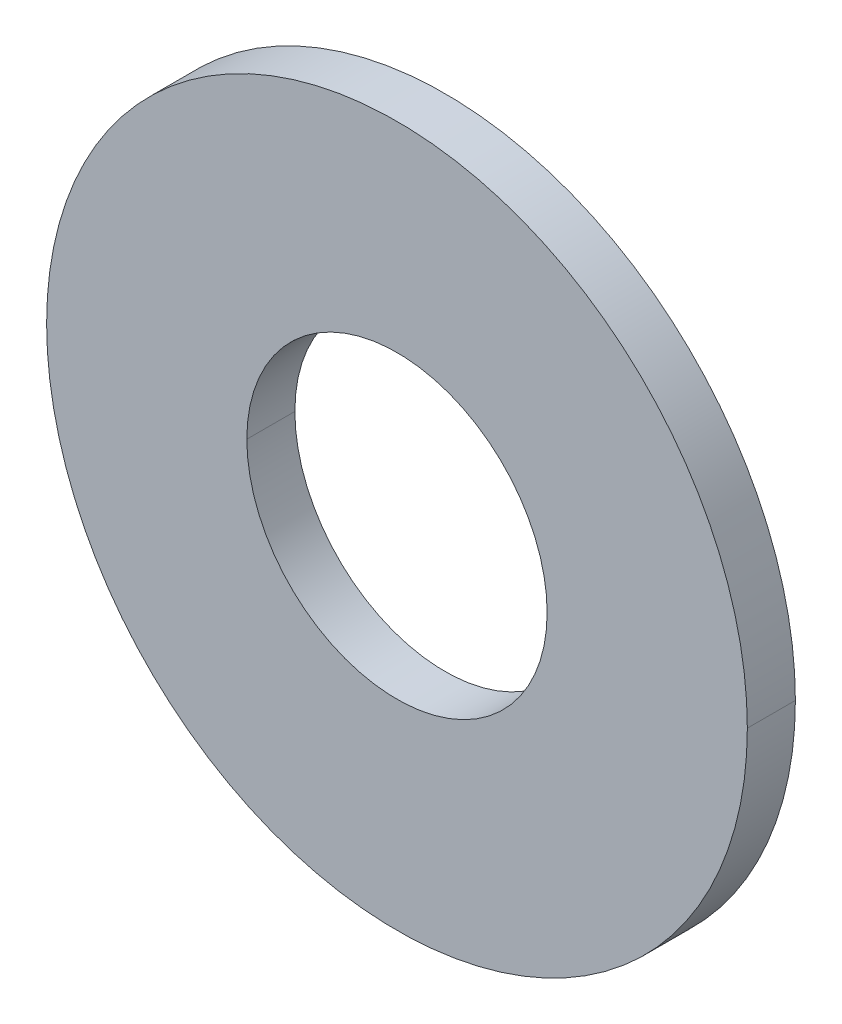
ISO-10303-21;
HEADER;
FILE_DESCRIPTION(('STEP AP214'),'2;1');
FILE_NAME('part.step','',(''),(''),'','','');
FILE_SCHEMA(('AUTOMOTIVE_DESIGN { 1 0 10303 214 1 1 1 1 }'));
ENDSEC;
DATA;
#1=APPLICATION_CONTEXT('core data for automotive mechanical design processes');
#2=APPLICATION_PROTOCOL_DEFINITION('international standard','automotive_design',2000,#1);
#3=PRODUCT_CONTEXT('',#1,'mechanical');
#4=PRODUCT('Part','Part','',(#3));
#5=PRODUCT_RELATED_PRODUCT_CATEGORY('part','',(#4));
#6=PRODUCT_DEFINITION_FORMATION('','',#4);
#7=PRODUCT_DEFINITION_CONTEXT('part definition',#1,'design');
#8=PRODUCT_DEFINITION('design','',#6,#7);
#9=PRODUCT_DEFINITION_SHAPE('','',#8);
#10=(LENGTH_UNIT() NAMED_UNIT(*) SI_UNIT(.MILLI.,.METRE.));
#11=(NAMED_UNIT(*) PLANE_ANGLE_UNIT() SI_UNIT($,.RADIAN.));
#12=(NAMED_UNIT(*) SI_UNIT($,.STERADIAN.) SOLID_ANGLE_UNIT());
#13=UNCERTAINTY_MEASURE_WITH_UNIT(LENGTH_MEASURE(1.E-05),#10,'distance_accuracy_value','');
#14=(GEOMETRIC_REPRESENTATION_CONTEXT(3) GLOBAL_UNCERTAINTY_ASSIGNED_CONTEXT((#13)) GLOBAL_UNIT_ASSIGNED_CONTEXT((#10,
#11,#12)) REPRESENTATION_CONTEXT('',''));
#15=CARTESIAN_POINT('',(0.,0.,0.));
#16=DIRECTION('',(0.,0.,1.));
#17=DIRECTION('',(1.,0.,0.));
#18=AXIS2_PLACEMENT_3D('',#15,#16,#17);
#19=CARTESIAN_POINT('',(0.,0.,-0.762));
#20=DIRECTION('',(0.,0.,1.));
#21=DIRECTION('',(1.,0.,0.));
#22=AXIS2_PLACEMENT_3D('',#19,#20,#21);
#23=CYLINDRICAL_SURFACE('',#22,2.38125);
#24=DIRECTION('',(0.,0.,1.));
#25=VECTOR('',#24,1.);
#26=CARTESIAN_POINT('',(-2.38125,0.,-0.762));
#27=LINE('',#26,#25);
#28=CARTESIAN_POINT('',(-2.38125,0.,-0.762));
#29=VERTEX_POINT('',#28);
#30=CARTESIAN_POINT('',(-2.38125,0.,0.));
#31=VERTEX_POINT('',#30);
#32=EDGE_CURVE('E113',#29,#31,#27,.T.);
#33=ORIENTED_EDGE('',*,*,#32,.F.);
#34=CARTESIAN_POINT('',(0.,0.,-0.762));
#35=DIRECTION('',(0.,0.,1.));
#36=DIRECTION('',(1.,0.,0.));
#37=AXIS2_PLACEMENT_3D('',#34,#35,#36);
#38=CIRCLE('',#37,2.38125);
#39=CARTESIAN_POINT('',(2.38125,0.,-0.762));
#40=VERTEX_POINT('',#39);
#41=EDGE_CURVE('E28',#40,#29,#38,.T.);
#42=ORIENTED_EDGE('',*,*,#41,.F.);
#43=DIRECTION('',(0.,0.,1.));
#44=VECTOR('',#43,1.);
#45=CARTESIAN_POINT('',(2.38125,0.,-0.762));
#46=LINE('',#45,#44);
#47=CARTESIAN_POINT('',(2.38125,0.,0.));
#48=VERTEX_POINT('',#47);
#49=EDGE_CURVE('E102',#40,#48,#46,.T.);
#50=ORIENTED_EDGE('',*,*,#49,.T.);
#51=CARTESIAN_POINT('',(0.,0.,0.));
#52=DIRECTION('',(0.,0.,1.));
#53=DIRECTION('',(1.,0.,0.));
#54=AXIS2_PLACEMENT_3D('',#51,#52,#53);
#55=CIRCLE('',#54,2.38125);
#56=EDGE_CURVE('E11',#48,#31,#55,.T.);
#57=ORIENTED_EDGE('',*,*,#56,.T.);
#58=EDGE_LOOP('',(#33,#42,#50,#57));
#59=FACE_BOUND('',#58,.T.);
#60=ADVANCED_FACE('F17',(#59),#23,.F.);
#61=CARTESIAN_POINT('',(0.,0.,0.));
#62=DIRECTION('',(0.,0.,1.));
#63=DIRECTION('',(1.,0.,0.));
#64=AXIS2_PLACEMENT_3D('',#61,#62,#63);
#65=PLANE('',#64);
#66=ORIENTED_EDGE('',*,*,#56,.F.);
#67=CARTESIAN_POINT('',(0.,0.,0.));
#68=DIRECTION('',(0.,0.,1.));
#69=DIRECTION('',(1.,0.,0.));
#70=AXIS2_PLACEMENT_3D('',#67,#68,#69);
#71=CIRCLE('',#70,2.38125);
#72=EDGE_CURVE('E109',#31,#48,#71,.T.);
#73=ORIENTED_EDGE('',*,*,#72,.F.);
#74=EDGE_LOOP('',(#66,#73));
#75=FACE_BOUND('',#74,.T.);
#76=CARTESIAN_POINT('',(0.,0.,0.));
#77=DIRECTION('',(0.,0.,1.));
#78=DIRECTION('',(1.,0.,0.));
#79=AXIS2_PLACEMENT_3D('',#76,#77,#78);
#80=CIRCLE('',#79,5.55625);
#81=CARTESIAN_POINT('',(5.55625,0.,0.));
#82=VERTEX_POINT('',#81);
#83=CARTESIAN_POINT('',(-5.55625,0.,0.));
#84=VERTEX_POINT('',#83);
#85=EDGE_CURVE('E99',#82,#84,#80,.T.);
#86=ORIENTED_EDGE('',*,*,#85,.T.);
#87=CARTESIAN_POINT('',(0.,0.,0.));
#88=DIRECTION('',(0.,0.,1.));
#89=DIRECTION('',(1.,0.,0.));
#90=AXIS2_PLACEMENT_3D('',#87,#88,#89);
#91=CIRCLE('',#90,5.55625);
#92=EDGE_CURVE('E42',#84,#82,#91,.T.);
#93=ORIENTED_EDGE('',*,*,#92,.T.);
#94=EDGE_LOOP('',(#86,#93));
#95=FACE_BOUND('',#94,.T.);
#96=ADVANCED_FACE('F142',(#75,#95),#65,.T.);
#97=CARTESIAN_POINT('',(0.,0.,-0.762));
#98=DIRECTION('',(0.,0.,1.));
#99=DIRECTION('',(1.,0.,0.));
#100=AXIS2_PLACEMENT_3D('',#97,#98,#99);
#101=PLANE('',#100);
#102=ORIENTED_EDGE('',*,*,#41,.T.);
#103=CARTESIAN_POINT('',(0.,0.,-0.762));
#104=DIRECTION('',(0.,0.,1.));
#105=DIRECTION('',(1.,0.,0.));
#106=AXIS2_PLACEMENT_3D('',#103,#104,#105);
#107=CIRCLE('',#106,2.38125);
#108=EDGE_CURVE('E117',#29,#40,#107,.T.);
#109=ORIENTED_EDGE('',*,*,#108,.T.);
#110=EDGE_LOOP('',(#102,#109));
#111=FACE_BOUND('',#110,.T.);
#112=CARTESIAN_POINT('',(0.,0.,-0.762));
#113=DIRECTION('',(0.,0.,1.));
#114=DIRECTION('',(1.,0.,0.));
#115=AXIS2_PLACEMENT_3D('',#112,#113,#114);
#116=CIRCLE('',#115,5.55625);
#117=CARTESIAN_POINT('',(5.55625,0.,-0.762));
#118=VERTEX_POINT('',#117);
#119=CARTESIAN_POINT('',(-5.55625,0.,-0.762));
#120=VERTEX_POINT('',#119);
#121=EDGE_CURVE('E91',#118,#120,#116,.T.);
#122=ORIENTED_EDGE('',*,*,#121,.F.);
#123=CARTESIAN_POINT('',(0.,0.,-0.762));
#124=DIRECTION('',(0.,0.,1.));
#125=DIRECTION('',(1.,0.,0.));
#126=AXIS2_PLACEMENT_3D('',#123,#124,#125);
#127=CIRCLE('',#126,5.55625);
#128=EDGE_CURVE('E81',#120,#118,#127,.T.);
#129=ORIENTED_EDGE('',*,*,#128,.F.);
#130=EDGE_LOOP('',(#122,#129));
#131=FACE_BOUND('',#130,.T.);
#132=ADVANCED_FACE('F89',(#111,#131),#101,.F.);
#133=CARTESIAN_POINT('',(0.,0.,-0.762));
#134=DIRECTION('',(0.,0.,1.));
#135=DIRECTION('',(1.,0.,0.));
#136=AXIS2_PLACEMENT_3D('',#133,#134,#135);
#137=CYLINDRICAL_SURFACE('',#136,5.55625);
#138=DIRECTION('',(0.,0.,1.));
#139=VECTOR('',#138,1.);
#140=CARTESIAN_POINT('',(-5.55625,0.,-0.762));
#141=LINE('',#140,#139);
#142=EDGE_CURVE('E21',#120,#84,#141,.T.);
#143=ORIENTED_EDGE('',*,*,#142,.F.);
#144=ORIENTED_EDGE('',*,*,#128,.T.);
#145=DIRECTION('',(0.,0.,1.));
#146=VECTOR('',#145,1.);
#147=CARTESIAN_POINT('',(5.55625,0.,-0.762));
#148=LINE('',#147,#146);
#149=EDGE_CURVE('E93',#118,#82,#148,.T.);
#150=ORIENTED_EDGE('',*,*,#149,.T.);
#151=ORIENTED_EDGE('',*,*,#92,.F.);
#152=EDGE_LOOP('',(#143,#144,#150,#151));
#153=FACE_BOUND('',#152,.T.);
#154=ADVANCED_FACE('F19',(#153),#137,.T.);
#155=CARTESIAN_POINT('',(0.,0.,-0.762));
#156=DIRECTION('',(0.,0.,1.));
#157=DIRECTION('',(1.,0.,0.));
#158=AXIS2_PLACEMENT_3D('',#155,#156,#157);
#159=CYLINDRICAL_SURFACE('',#158,5.55625);
#160=ORIENTED_EDGE('',*,*,#121,.T.);
#161=ORIENTED_EDGE('',*,*,#142,.T.);
#162=ORIENTED_EDGE('',*,*,#85,.F.);
#163=ORIENTED_EDGE('',*,*,#149,.F.);
#164=EDGE_LOOP('',(#160,#161,#162,#163));
#165=FACE_BOUND('',#164,.T.);
#166=ADVANCED_FACE('F100',(#165),#159,.T.);
#167=CARTESIAN_POINT('',(0.,0.,-0.762));
#168=DIRECTION('',(0.,0.,1.));
#169=DIRECTION('',(1.,0.,0.));
#170=AXIS2_PLACEMENT_3D('',#167,#168,#169);
#171=CYLINDRICAL_SURFACE('',#170,2.38125);
#172=ORIENTED_EDGE('',*,*,#108,.F.);
#173=ORIENTED_EDGE('',*,*,#32,.T.);
#174=ORIENTED_EDGE('',*,*,#72,.T.);
#175=ORIENTED_EDGE('',*,*,#49,.F.);
#176=EDGE_LOOP('',(#172,#173,#174,#175));
#177=FACE_BOUND('',#176,.T.);
#178=ADVANCED_FACE('F159',(#177),#171,.F.);
#179=CLOSED_SHELL('',(#60,#96,#132,#154,#166,#178));
#180=MANIFOLD_SOLID_BREP('B1',#179);
#181=ADVANCED_BREP_SHAPE_REPRESENTATION('',(#18,#180),#14);
#182=SHAPE_DEFINITION_REPRESENTATION(#9,#181);
ENDSEC;
END-ISO-10303-21;
